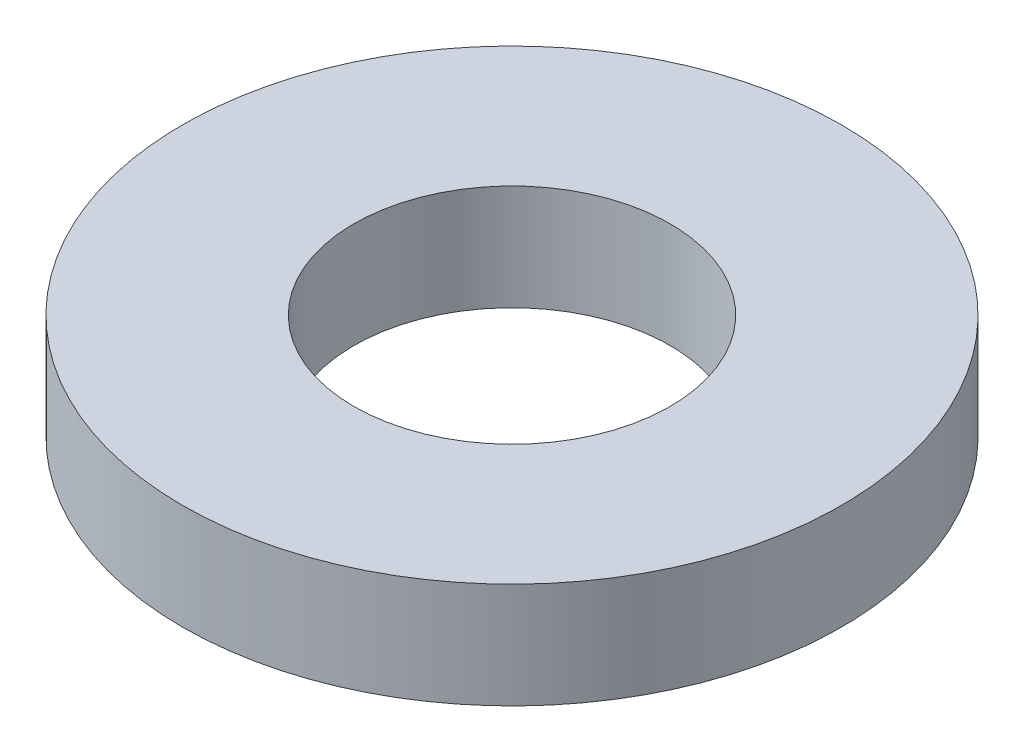
ISO-10303-21;
HEADER;
FILE_DESCRIPTION(('STEP AP214'),'2;1');
FILE_NAME('part.step','',(''),(''),'','','');
FILE_SCHEMA(('AUTOMOTIVE_DESIGN { 1 0 10303 214 1 1 1 1 }'));
ENDSEC;
DATA;
#1=APPLICATION_CONTEXT('core data for automotive mechanical design processes');
#2=APPLICATION_PROTOCOL_DEFINITION('international standard','automotive_design',2000,#1);
#3=PRODUCT_CONTEXT('',#1,'mechanical');
#4=PRODUCT('Part','Part','',(#3));
#5=PRODUCT_RELATED_PRODUCT_CATEGORY('part','',(#4));
#6=PRODUCT_DEFINITION_FORMATION('','',#4);
#7=PRODUCT_DEFINITION_CONTEXT('part definition',#1,'design');
#8=PRODUCT_DEFINITION('design','',#6,#7);
#9=PRODUCT_DEFINITION_SHAPE('','',#8);
#10=(LENGTH_UNIT() NAMED_UNIT(*) SI_UNIT(.MILLI.,.METRE.));
#11=(NAMED_UNIT(*) PLANE_ANGLE_UNIT() SI_UNIT($,.RADIAN.));
#12=(NAMED_UNIT(*) SI_UNIT($,.STERADIAN.) SOLID_ANGLE_UNIT());
#13=UNCERTAINTY_MEASURE_WITH_UNIT(LENGTH_MEASURE(1.E-05),#10,'distance_accuracy_value','');
#14=(GEOMETRIC_REPRESENTATION_CONTEXT(3) GLOBAL_UNCERTAINTY_ASSIGNED_CONTEXT((#13)) GLOBAL_UNIT_ASSIGNED_CONTEXT((#10,
#11,#12)) REPRESENTATION_CONTEXT('',''));
#15=CARTESIAN_POINT('',(0.,0.,0.));
#16=DIRECTION('',(0.,0.,1.));
#17=DIRECTION('',(1.,0.,0.));
#18=AXIS2_PLACEMENT_3D('',#15,#16,#17);
#19=CARTESIAN_POINT('',(0.,20.,0.));
#20=DIRECTION('',(0.,-1.,0.));
#21=DIRECTION('',(0.,0.,-1.));
#22=AXIS2_PLACEMENT_3D('',#19,#20,#21);
#23=CYLINDRICAL_SURFACE('',#22,62.5);
#24=CARTESIAN_POINT('',(0.,20.,0.));
#25=DIRECTION('',(0.,1.,0.));
#26=DIRECTION('',(0.,0.,1.));
#27=AXIS2_PLACEMENT_3D('',#24,#25,#26);
#28=CIRCLE('',#27,62.5);
#29=CARTESIAN_POINT('',(0.,20.,62.5));
#30=VERTEX_POINT('',#29);
#31=EDGE_CURVE('E10',#30,#30,#28,.T.);
#32=ORIENTED_EDGE('',*,*,#31,.F.);
#33=EDGE_LOOP('',(#32));
#34=FACE_BOUND('',#33,.T.);
#35=CARTESIAN_POINT('',(0.,0.,0.));
#36=DIRECTION('',(0.,1.,0.));
#37=DIRECTION('',(0.,0.,1.));
#38=AXIS2_PLACEMENT_3D('',#35,#36,#37);
#39=CIRCLE('',#38,62.5);
#40=CARTESIAN_POINT('',(0.,0.,62.5));
#41=VERTEX_POINT('',#40);
#42=EDGE_CURVE('E37',#41,#41,#39,.T.);
#43=ORIENTED_EDGE('',*,*,#42,.T.);
#44=EDGE_LOOP('',(#43));
#45=FACE_BOUND('',#44,.T.);
#46=ADVANCED_FACE('F40',(#34,#45),#23,.T.);
#47=CARTESIAN_POINT('',(0.,20.,0.));
#48=DIRECTION('',(0.,1.,0.));
#49=DIRECTION('',(0.,0.,1.));
#50=AXIS2_PLACEMENT_3D('',#47,#48,#49);
#51=PLANE('',#50);
#52=CARTESIAN_POINT('',(0.,20.,0.));
#53=DIRECTION('',(0.,1.,0.));
#54=DIRECTION('',(0.,0.,1.));
#55=AXIS2_PLACEMENT_3D('',#52,#53,#54);
#56=CIRCLE('',#55,30.);
#57=CARTESIAN_POINT('',(0.,20.,30.));
#58=VERTEX_POINT('',#57);
#59=EDGE_CURVE('E50',#58,#58,#56,.T.);
#60=ORIENTED_EDGE('',*,*,#59,.F.);
#61=EDGE_LOOP('',(#60));
#62=FACE_BOUND('',#61,.T.);
#63=ORIENTED_EDGE('',*,*,#31,.T.);
#64=EDGE_LOOP('',(#63));
#65=FACE_BOUND('',#64,.T.);
#66=ADVANCED_FACE('F59',(#62,#65),#51,.T.);
#67=CARTESIAN_POINT('',(0.,0.,0.));
#68=DIRECTION('',(0.,1.,0.));
#69=DIRECTION('',(0.,0.,1.));
#70=AXIS2_PLACEMENT_3D('',#67,#68,#69);
#71=PLANE('',#70);
#72=CARTESIAN_POINT('',(0.,0.,0.));
#73=DIRECTION('',(0.,1.,0.));
#74=DIRECTION('',(0.,0.,1.));
#75=AXIS2_PLACEMENT_3D('',#72,#73,#74);
#76=CIRCLE('',#75,30.);
#77=CARTESIAN_POINT('',(0.,0.,30.));
#78=VERTEX_POINT('',#77);
#79=EDGE_CURVE('E47',#78,#78,#76,.T.);
#80=ORIENTED_EDGE('',*,*,#79,.T.);
#81=EDGE_LOOP('',(#80));
#82=FACE_BOUND('',#81,.T.);
#83=ORIENTED_EDGE('',*,*,#42,.F.);
#84=EDGE_LOOP('',(#83));
#85=FACE_BOUND('',#84,.T.);
#86=ADVANCED_FACE('F58',(#82,#85),#71,.F.);
#87=CARTESIAN_POINT('',(0.,20.,0.));
#88=DIRECTION('',(0.,-1.,0.));
#89=DIRECTION('',(0.,0.,-1.));
#90=AXIS2_PLACEMENT_3D('',#87,#88,#89);
#91=CYLINDRICAL_SURFACE('',#90,30.);
#92=ORIENTED_EDGE('',*,*,#59,.T.);
#93=EDGE_LOOP('',(#92));
#94=FACE_BOUND('',#93,.T.);
#95=ORIENTED_EDGE('',*,*,#79,.F.);
#96=EDGE_LOOP('',(#95));
#97=FACE_BOUND('',#96,.T.);
#98=ADVANCED_FACE('F54',(#94,#97),#91,.F.);
#99=CLOSED_SHELL('',(#46,#66,#86,#98));
#100=MANIFOLD_SOLID_BREP('B2',#99);
#101=ADVANCED_BREP_SHAPE_REPRESENTATION('',(#18,#100),#14);
#102=SHAPE_DEFINITION_REPRESENTATION(#9,#101);
ENDSEC;
END-ISO-10303-21;
